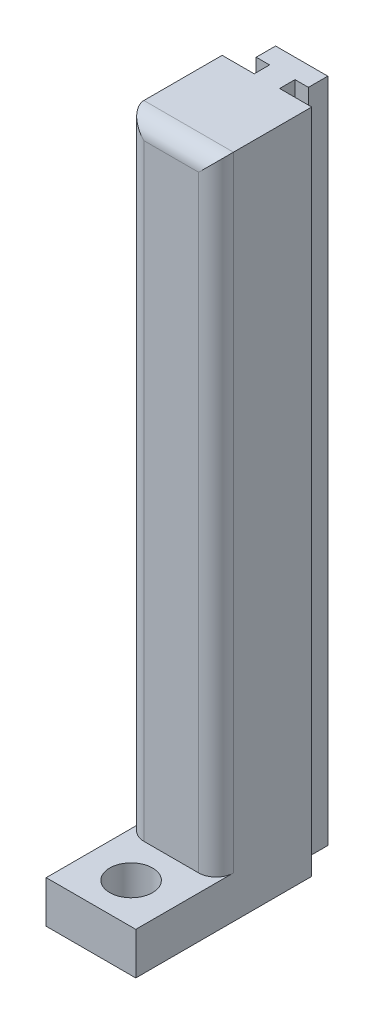
ISO-10303-21;
HEADER;
FILE_DESCRIPTION(('STEP AP214'),'2;1');
FILE_NAME('part.step','',(''),(''),'','','');
FILE_SCHEMA(('AUTOMOTIVE_DESIGN { 1 0 10303 214 1 1 1 1 }'));
ENDSEC;
DATA;
#1=APPLICATION_CONTEXT('core data for automotive mechanical design processes');
#2=APPLICATION_PROTOCOL_DEFINITION('international standard','automotive_design',2000,#1);
#3=PRODUCT_CONTEXT('',#1,'mechanical');
#4=PRODUCT('Part','Part','',(#3));
#5=PRODUCT_RELATED_PRODUCT_CATEGORY('part','',(#4));
#6=PRODUCT_DEFINITION_FORMATION('','',#4);
#7=PRODUCT_DEFINITION_CONTEXT('part definition',#1,'design');
#8=PRODUCT_DEFINITION('design','',#6,#7);
#9=PRODUCT_DEFINITION_SHAPE('','',#8);
#10=(LENGTH_UNIT() NAMED_UNIT(*) SI_UNIT(.MILLI.,.METRE.));
#11=(NAMED_UNIT(*) PLANE_ANGLE_UNIT() SI_UNIT($,.RADIAN.));
#12=(NAMED_UNIT(*) SI_UNIT($,.STERADIAN.) SOLID_ANGLE_UNIT());
#13=UNCERTAINTY_MEASURE_WITH_UNIT(LENGTH_MEASURE(1.E-05),#10,'distance_accuracy_value','');
#14=(GEOMETRIC_REPRESENTATION_CONTEXT(3) GLOBAL_UNCERTAINTY_ASSIGNED_CONTEXT((#13)) GLOBAL_UNIT_ASSIGNED_CONTEXT((#10,
#11,#12)) REPRESENTATION_CONTEXT('',''));
#15=CARTESIAN_POINT('',(0.,0.,0.));
#16=DIRECTION('',(0.,0.,1.));
#17=DIRECTION('',(1.,0.,0.));
#18=AXIS2_PLACEMENT_3D('',#15,#16,#17);
#19=CARTESIAN_POINT('',(4.25,63.246,-10.));
#20=DIRECTION('',(0.,0.,1.));
#21=DIRECTION('',(1.,0.,0.));
#22=AXIS2_PLACEMENT_3D('',#19,#20,#21);
#23=PLANE('',#22);
#24=DIRECTION('',(0.,-1.,0.));
#25=VECTOR('',#24,1.);
#26=CARTESIAN_POINT('',(2.4765,68.58,-10.));
#27=LINE('',#26,#25);
#28=CARTESIAN_POINT('',(2.4765,63.246,-10.));
#29=VERTEX_POINT('',#28);
#30=CARTESIAN_POINT('',(2.4765,0.,-10.));
#31=VERTEX_POINT('',#30);
#32=EDGE_CURVE('E150',#29,#31,#27,.T.);
#33=ORIENTED_EDGE('',*,*,#32,.T.);
#34=DIRECTION('',(-1.,0.,0.));
#35=VECTOR('',#34,1.);
#36=CARTESIAN_POINT('',(4.25,0.,-10.));
#37=LINE('',#36,#35);
#38=CARTESIAN_POINT('',(-2.4765,0.,-10.));
#39=VERTEX_POINT('',#38);
#40=EDGE_CURVE('E191',#31,#39,#37,.T.);
#41=ORIENTED_EDGE('',*,*,#40,.T.);
#42=DIRECTION('',(0.,-1.,0.));
#43=VECTOR('',#42,1.);
#44=CARTESIAN_POINT('',(-2.4765,68.58,-10.));
#45=LINE('',#44,#43);
#46=CARTESIAN_POINT('',(-2.4765,63.246,-10.));
#47=VERTEX_POINT('',#46);
#48=EDGE_CURVE('E176',#47,#39,#45,.T.);
#49=ORIENTED_EDGE('',*,*,#48,.F.);
#50=DIRECTION('',(-1.,0.,0.));
#51=VECTOR('',#50,1.);
#52=CARTESIAN_POINT('',(4.25,63.246,-10.));
#53=LINE('',#52,#51);
#54=EDGE_CURVE('E168',#29,#47,#53,.T.);
#55=ORIENTED_EDGE('',*,*,#54,.F.);
#56=EDGE_LOOP('',(#33,#41,#49,#55));
#57=FACE_BOUND('',#56,.T.);
#58=ADVANCED_FACE('F37',(#57),#23,.F.);
#59=CARTESIAN_POINT('',(0.,63.246,0.));
#60=DIRECTION('',(0.,1.,0.));
#61=DIRECTION('',(0.,0.,1.));
#62=AXIS2_PLACEMENT_3D('',#59,#60,#61);
#63=PLANE('',#62);
#64=DIRECTION('',(0.,0.,1.));
#65=VECTOR('',#64,1.);
#66=CARTESIAN_POINT('',(-4.25,63.246,-10.));
#67=LINE('',#66,#65);
#68=CARTESIAN_POINT('',(-4.25,63.246,-6.698));
#69=VERTEX_POINT('',#68);
#70=CARTESIAN_POINT('',(-4.25,63.246,0.729000000000002));
#71=VERTEX_POINT('',#70);
#72=EDGE_CURVE('E177',#69,#71,#67,.T.);
#73=ORIENTED_EDGE('',*,*,#72,.T.);
#74=DIRECTION('',(-1.,0.,0.));
#75=VECTOR('',#74,1.);
#76=CARTESIAN_POINT('',(4.25,63.246,0.729000000000001));
#77=LINE('',#76,#75);
#78=CARTESIAN_POINT('',(4.25,63.246,0.729000000000001));
#79=VERTEX_POINT('',#78);
#80=EDGE_CURVE('E228',#71,#79,#77,.F.);
#81=ORIENTED_EDGE('',*,*,#80,.T.);
#82=DIRECTION('',(0.,0.,-1.));
#83=VECTOR('',#82,1.);
#84=CARTESIAN_POINT('',(4.25,63.246,10.));
#85=LINE('',#84,#83);
#86=CARTESIAN_POINT('',(4.25,63.246,-6.698));
#87=VERTEX_POINT('',#86);
#88=EDGE_CURVE('E180',#79,#87,#85,.T.);
#89=ORIENTED_EDGE('',*,*,#88,.T.);
#90=DIRECTION('',(-1.,0.,0.));
#91=VECTOR('',#90,1.);
#92=CARTESIAN_POINT('',(0.,63.246,-6.698));
#93=LINE('',#92,#91);
#94=CARTESIAN_POINT('',(1.2065,63.246,-6.698));
#95=VERTEX_POINT('',#94);
#96=EDGE_CURVE('E257',#87,#95,#93,.T.);
#97=ORIENTED_EDGE('',*,*,#96,.T.);
#98=DIRECTION('',(0.,0.,-1.));
#99=VECTOR('',#98,1.);
#100=CARTESIAN_POINT('',(1.2065,63.246,0.));
#101=LINE('',#100,#99);
#102=CARTESIAN_POINT('',(1.2065,63.246,-8.1585));
#103=VERTEX_POINT('',#102);
#104=EDGE_CURVE('E172',#95,#103,#101,.T.);
#105=ORIENTED_EDGE('',*,*,#104,.T.);
#106=DIRECTION('',(1.,0.,0.));
#107=VECTOR('',#106,1.);
#108=CARTESIAN_POINT('',(0.,63.246,-8.1585));
#109=LINE('',#108,#107);
#110=CARTESIAN_POINT('',(2.4765,63.246,-8.1585));
#111=VERTEX_POINT('',#110);
#112=EDGE_CURVE('E171',#103,#111,#109,.T.);
#113=ORIENTED_EDGE('',*,*,#112,.T.);
#114=DIRECTION('',(0.,0.,-1.));
#115=VECTOR('',#114,1.);
#116=CARTESIAN_POINT('',(2.4765,63.246,0.));
#117=LINE('',#116,#115);
#118=EDGE_CURVE('E154',#111,#29,#117,.T.);
#119=ORIENTED_EDGE('',*,*,#118,.T.);
#120=ORIENTED_EDGE('',*,*,#54,.T.);
#121=DIRECTION('',(0.,0.,1.));
#122=VECTOR('',#121,1.);
#123=CARTESIAN_POINT('',(-2.4765,63.246,0.));
#124=LINE('',#123,#122);
#125=CARTESIAN_POINT('',(-2.4765,63.246,-8.1585));
#126=VERTEX_POINT('',#125);
#127=EDGE_CURVE('E277',#47,#126,#124,.T.);
#128=ORIENTED_EDGE('',*,*,#127,.T.);
#129=DIRECTION('',(1.,0.,0.));
#130=VECTOR('',#129,1.);
#131=CARTESIAN_POINT('',(0.,63.246,-8.1585));
#132=LINE('',#131,#130);
#133=CARTESIAN_POINT('',(-1.2065,63.246,-8.1585));
#134=VERTEX_POINT('',#133);
#135=EDGE_CURVE('E279',#126,#134,#132,.T.);
#136=ORIENTED_EDGE('',*,*,#135,.T.);
#137=DIRECTION('',(0.,0.,1.));
#138=VECTOR('',#137,1.);
#139=CARTESIAN_POINT('',(-1.2065,63.246,0.));
#140=LINE('',#139,#138);
#141=CARTESIAN_POINT('',(-1.2065,63.246,-6.698));
#142=VERTEX_POINT('',#141);
#143=EDGE_CURVE('E282',#134,#142,#140,.T.);
#144=ORIENTED_EDGE('',*,*,#143,.T.);
#145=DIRECTION('',(-1.,0.,0.));
#146=VECTOR('',#145,1.);
#147=CARTESIAN_POINT('',(0.,63.246,-6.698));
#148=LINE('',#147,#146);
#149=EDGE_CURVE('E274',#142,#69,#148,.T.);
#150=ORIENTED_EDGE('',*,*,#149,.T.);
#151=EDGE_LOOP('',(#73,#81,#89,#97,#105,#113,#119,#120,#128,#136,#144,#150));
#152=FACE_BOUND('',#151,.T.);
#153=ADVANCED_FACE('F166',(#152),#63,.T.);
#154=CARTESIAN_POINT('',(0.,0.,0.));
#155=DIRECTION('',(0.,1.,0.));
#156=DIRECTION('',(0.,0.,1.));
#157=AXIS2_PLACEMENT_3D('',#154,#155,#156);
#158=PLANE('',#157);
#159=CARTESIAN_POINT('',(0.,0.,6.19));
#160=DIRECTION('',(0.,1.,0.));
#161=DIRECTION('',(0.,0.,1.));
#162=AXIS2_PLACEMENT_3D('',#159,#160,#161);
#163=CIRCLE('',#162,2.032);
#164=CARTESIAN_POINT('',(0.,0.,8.222));
#165=VERTEX_POINT('',#164);
#166=EDGE_CURVE('E242',#165,#165,#163,.T.);
#167=ORIENTED_EDGE('',*,*,#166,.T.);
#168=EDGE_LOOP('',(#167));
#169=FACE_BOUND('',#168,.T.);
#170=DIRECTION('',(-1.,0.,0.));
#171=VECTOR('',#170,1.);
#172=CARTESIAN_POINT('',(0.,0.,-6.698));
#173=LINE('',#172,#171);
#174=CARTESIAN_POINT('',(4.25,0.,-6.698));
#175=VERTEX_POINT('',#174);
#176=CARTESIAN_POINT('',(1.2065,0.,-6.698));
#177=VERTEX_POINT('',#176);
#178=EDGE_CURVE('E255',#175,#177,#173,.T.);
#179=ORIENTED_EDGE('',*,*,#178,.F.);
#180=DIRECTION('',(0.,0.,-1.));
#181=VECTOR('',#180,1.);
#182=CARTESIAN_POINT('',(4.25,0.,10.));
#183=LINE('',#182,#181);
#184=CARTESIAN_POINT('',(4.25,0.,10.));
#185=VERTEX_POINT('',#184);
#186=EDGE_CURVE('E178',#185,#175,#183,.T.);
#187=ORIENTED_EDGE('',*,*,#186,.F.);
#188=DIRECTION('',(1.,0.,0.));
#189=VECTOR('',#188,1.);
#190=CARTESIAN_POINT('',(-4.25,0.,10.));
#191=LINE('',#190,#189);
#192=CARTESIAN_POINT('',(-4.25,0.,10.));
#193=VERTEX_POINT('',#192);
#194=EDGE_CURVE('E183',#193,#185,#191,.T.);
#195=ORIENTED_EDGE('',*,*,#194,.F.);
#196=DIRECTION('',(0.,0.,1.));
#197=VECTOR('',#196,1.);
#198=CARTESIAN_POINT('',(-4.25,0.,-10.));
#199=LINE('',#198,#197);
#200=CARTESIAN_POINT('',(-4.25,0.,-6.698));
#201=VERTEX_POINT('',#200);
#202=EDGE_CURVE('E193',#201,#193,#199,.T.);
#203=ORIENTED_EDGE('',*,*,#202,.F.);
#204=DIRECTION('',(-1.,0.,0.));
#205=VECTOR('',#204,1.);
#206=CARTESIAN_POINT('',(0.,0.,-6.698));
#207=LINE('',#206,#205);
#208=CARTESIAN_POINT('',(-1.2065,0.,-6.698));
#209=VERTEX_POINT('',#208);
#210=EDGE_CURVE('E201',#209,#201,#207,.T.);
#211=ORIENTED_EDGE('',*,*,#210,.F.);
#212=DIRECTION('',(0.,0.,1.));
#213=VECTOR('',#212,1.);
#214=CARTESIAN_POINT('',(-1.2065,0.,0.));
#215=LINE('',#214,#213);
#216=CARTESIAN_POINT('',(-1.2065,0.,-8.1585));
#217=VERTEX_POINT('',#216);
#218=EDGE_CURVE('E203',#217,#209,#215,.T.);
#219=ORIENTED_EDGE('',*,*,#218,.F.);
#220=DIRECTION('',(1.,0.,0.));
#221=VECTOR('',#220,1.);
#222=CARTESIAN_POINT('',(0.,0.,-8.1585));
#223=LINE('',#222,#221);
#224=CARTESIAN_POINT('',(-2.4765,0.,-8.1585));
#225=VERTEX_POINT('',#224);
#226=EDGE_CURVE('E206',#225,#217,#223,.T.);
#227=ORIENTED_EDGE('',*,*,#226,.F.);
#228=DIRECTION('',(0.,0.,1.));
#229=VECTOR('',#228,1.);
#230=CARTESIAN_POINT('',(-2.4765,0.,0.));
#231=LINE('',#230,#229);
#232=EDGE_CURVE('E208',#39,#225,#231,.T.);
#233=ORIENTED_EDGE('',*,*,#232,.F.);
#234=ORIENTED_EDGE('',*,*,#40,.F.);
#235=DIRECTION('',(0.,0.,-1.));
#236=VECTOR('',#235,1.);
#237=CARTESIAN_POINT('',(2.4765,0.,0.));
#238=LINE('',#237,#236);
#239=CARTESIAN_POINT('',(2.4765,0.,-8.1585));
#240=VERTEX_POINT('',#239);
#241=EDGE_CURVE('E157',#240,#31,#238,.T.);
#242=ORIENTED_EDGE('',*,*,#241,.F.);
#243=DIRECTION('',(1.,0.,0.));
#244=VECTOR('',#243,1.);
#245=CARTESIAN_POINT('',(0.,0.,-8.1585));
#246=LINE('',#245,#244);
#247=CARTESIAN_POINT('',(1.2065,0.,-8.1585));
#248=VERTEX_POINT('',#247);
#249=EDGE_CURVE('E212',#248,#240,#246,.T.);
#250=ORIENTED_EDGE('',*,*,#249,.F.);
#251=DIRECTION('',(0.,0.,-1.));
#252=VECTOR('',#251,1.);
#253=CARTESIAN_POINT('',(1.2065,0.,0.));
#254=LINE('',#253,#252);
#255=EDGE_CURVE('E215',#177,#248,#254,.T.);
#256=ORIENTED_EDGE('',*,*,#255,.F.);
#257=EDGE_LOOP('',(#179,#187,#195,#203,#211,#219,#227,#233,#234,#242,#250,#256));
#258=FACE_BOUND('',#257,.T.);
#259=ADVANCED_FACE('F316',(#169,#258),#158,.F.);
#260=CARTESIAN_POINT('',(4.25,63.246,10.));
#261=DIRECTION('',(-1.,0.,0.));
#262=DIRECTION('',(0.,0.,1.));
#263=AXIS2_PLACEMENT_3D('',#260,#261,#262);
#264=PLANE('',#263);
#265=ORIENTED_EDGE('',*,*,#88,.F.);
#266=DIRECTION('',(0.,1.,0.));
#267=VECTOR('',#266,1.);
#268=CARTESIAN_POINT('',(4.25,63.246,0.729000000000002));
#269=LINE('',#268,#267);
#270=CARTESIAN_POINT('',(4.25,4.,0.729000000000002));
#271=VERTEX_POINT('',#270);
#272=EDGE_CURVE('E224',#79,#271,#269,.F.);
#273=ORIENTED_EDGE('',*,*,#272,.T.);
#274=DIRECTION('',(0.,0.,1.));
#275=VECTOR('',#274,1.);
#276=CARTESIAN_POINT('',(4.25,4.,10.));
#277=LINE('',#276,#275);
#278=CARTESIAN_POINT('',(4.25,4.,10.));
#279=VERTEX_POINT('',#278);
#280=EDGE_CURVE('E288',#271,#279,#277,.T.);
#281=ORIENTED_EDGE('',*,*,#280,.T.);
#282=DIRECTION('',(0.,-1.,0.));
#283=VECTOR('',#282,1.);
#284=CARTESIAN_POINT('',(4.25,63.246,10.));
#285=LINE('',#284,#283);
#286=EDGE_CURVE('E190',#279,#185,#285,.T.);
#287=ORIENTED_EDGE('',*,*,#286,.T.);
#288=ORIENTED_EDGE('',*,*,#186,.T.);
#289=DIRECTION('',(0.,-1.,0.));
#290=VECTOR('',#289,1.);
#291=CARTESIAN_POINT('',(4.25,63.246,-6.698));
#292=LINE('',#291,#290);
#293=EDGE_CURVE('E210',#87,#175,#292,.T.);
#294=ORIENTED_EDGE('',*,*,#293,.F.);
#295=EDGE_LOOP('',(#265,#273,#281,#287,#288,#294));
#296=FACE_BOUND('',#295,.T.);
#297=ADVANCED_FACE('F303',(#296),#264,.F.);
#298=CARTESIAN_POINT('',(-4.25,63.246,-10.));
#299=DIRECTION('',(1.,0.,0.));
#300=DIRECTION('',(0.,0.,-1.));
#301=AXIS2_PLACEMENT_3D('',#298,#299,#300);
#302=PLANE('',#301);
#303=DIRECTION('',(0.,0.,-1.));
#304=VECTOR('',#303,1.);
#305=CARTESIAN_POINT('',(-4.25,4.,2.38));
#306=LINE('',#305,#304);
#307=CARTESIAN_POINT('',(-4.25,4.,10.));
#308=VERTEX_POINT('',#307);
#309=CARTESIAN_POINT('',(-4.25,4.,0.729000000000001));
#310=VERTEX_POINT('',#309);
#311=EDGE_CURVE('E54',#308,#310,#306,.T.);
#312=ORIENTED_EDGE('',*,*,#311,.T.);
#313=DIRECTION('',(0.,1.,0.));
#314=VECTOR('',#313,1.);
#315=CARTESIAN_POINT('',(-4.25,63.246,0.729000000000001));
#316=LINE('',#315,#314);
#317=EDGE_CURVE('E58',#310,#71,#316,.T.);
#318=ORIENTED_EDGE('',*,*,#317,.T.);
#319=ORIENTED_EDGE('',*,*,#72,.F.);
#320=DIRECTION('',(0.,-1.,0.));
#321=VECTOR('',#320,1.);
#322=CARTESIAN_POINT('',(-4.25,68.58,-6.698));
#323=LINE('',#322,#321);
#324=EDGE_CURVE('E264',#69,#201,#323,.T.);
#325=ORIENTED_EDGE('',*,*,#324,.T.);
#326=ORIENTED_EDGE('',*,*,#202,.T.);
#327=DIRECTION('',(0.,-1.,0.));
#328=VECTOR('',#327,1.);
#329=CARTESIAN_POINT('',(-4.25,63.246,10.));
#330=LINE('',#329,#328);
#331=EDGE_CURVE('E198',#308,#193,#330,.T.);
#332=ORIENTED_EDGE('',*,*,#331,.F.);
#333=EDGE_LOOP('',(#312,#318,#319,#325,#326,#332));
#334=FACE_BOUND('',#333,.T.);
#335=ADVANCED_FACE('F338',(#334),#302,.F.);
#336=CARTESIAN_POINT('',(-4.25,63.246,10.));
#337=DIRECTION('',(0.,0.,-1.));
#338=DIRECTION('',(-1.,0.,0.));
#339=AXIS2_PLACEMENT_3D('',#336,#337,#338);
#340=PLANE('',#339);
#341=DIRECTION('',(-1.,0.,0.));
#342=VECTOR('',#341,1.);
#343=CARTESIAN_POINT('',(-4.25,4.,10.));
#344=LINE('',#343,#342);
#345=EDGE_CURVE('E286',#279,#308,#344,.T.);
#346=ORIENTED_EDGE('',*,*,#345,.T.);
#347=ORIENTED_EDGE('',*,*,#331,.T.);
#348=ORIENTED_EDGE('',*,*,#194,.T.);
#349=ORIENTED_EDGE('',*,*,#286,.F.);
#350=EDGE_LOOP('',(#346,#347,#348,#349));
#351=FACE_BOUND('',#350,.T.);
#352=ADVANCED_FACE('F351',(#351),#340,.F.);
#353=CARTESIAN_POINT('',(4.25,-11.4155332770747,2.38));
#354=DIRECTION('',(0.,0.,-1.));
#355=DIRECTION('',(-1.,0.,0.));
#356=AXIS2_PLACEMENT_3D('',#353,#354,#355);
#357=PLANE('',#356);
#358=DIRECTION('',(1.,0.,0.));
#359=VECTOR('',#358,1.);
#360=CARTESIAN_POINT('',(4.25,4.,2.38));
#361=LINE('',#360,#359);
#362=CARTESIAN_POINT('',(-2.599,4.,2.38));
#363=VERTEX_POINT('',#362);
#364=CARTESIAN_POINT('',(2.599,4.,2.38));
#365=VERTEX_POINT('',#364);
#366=EDGE_CURVE('E186',#363,#365,#361,.T.);
#367=ORIENTED_EDGE('',*,*,#366,.T.);
#368=DIRECTION('',(0.,1.,0.));
#369=VECTOR('',#368,1.);
#370=CARTESIAN_POINT('',(2.599,-11.4155332770747,2.38));
#371=LINE('',#370,#369);
#372=CARTESIAN_POINT('',(2.599,61.595,2.38));
#373=VERTEX_POINT('',#372);
#374=EDGE_CURVE('E221',#365,#373,#371,.T.);
#375=ORIENTED_EDGE('',*,*,#374,.T.);
#376=DIRECTION('',(-1.,0.,0.));
#377=VECTOR('',#376,1.);
#378=CARTESIAN_POINT('',(-4.25,61.595,2.38));
#379=LINE('',#378,#377);
#380=CARTESIAN_POINT('',(-2.599,61.595,2.38));
#381=VERTEX_POINT('',#380);
#382=EDGE_CURVE('E217',#373,#381,#379,.T.);
#383=ORIENTED_EDGE('',*,*,#382,.T.);
#384=DIRECTION('',(0.,1.,0.));
#385=VECTOR('',#384,1.);
#386=CARTESIAN_POINT('',(-2.599,-11.4155332770747,2.38));
#387=LINE('',#386,#385);
#388=EDGE_CURVE('E219',#381,#363,#387,.F.);
#389=ORIENTED_EDGE('',*,*,#388,.T.);
#390=EDGE_LOOP('',(#367,#375,#383,#389));
#391=FACE_BOUND('',#390,.T.);
#392=ADVANCED_FACE('F295',(#391),#357,.F.);
#393=CARTESIAN_POINT('',(0.,4.,0.));
#394=DIRECTION('',(0.,1.,0.));
#395=DIRECTION('',(0.,0.,1.));
#396=AXIS2_PLACEMENT_3D('',#393,#394,#395);
#397=PLANE('',#396);
#398=CARTESIAN_POINT('',(0.,4.,6.19));
#399=DIRECTION('',(0.,1.,0.));
#400=DIRECTION('',(0.,0.,1.));
#401=AXIS2_PLACEMENT_3D('',#398,#399,#400);
#402=CIRCLE('',#401,2.032);
#403=CARTESIAN_POINT('',(0.,4.,8.222));
#404=VERTEX_POINT('',#403);
#405=EDGE_CURVE('E237',#404,#404,#402,.T.);
#406=ORIENTED_EDGE('',*,*,#405,.F.);
#407=EDGE_LOOP('',(#406));
#408=FACE_BOUND('',#407,.T.);
#409=ORIENTED_EDGE('',*,*,#280,.F.);
#410=CARTESIAN_POINT('',(2.599,4.,0.729000000000001));
#411=DIRECTION('',(0.,1.,0.));
#412=DIRECTION('',(0.,0.,1.));
#413=AXIS2_PLACEMENT_3D('',#410,#411,#412);
#414=CIRCLE('',#413,1.651);
#415=EDGE_CURVE('E46',#271,#365,#414,.F.);
#416=ORIENTED_EDGE('',*,*,#415,.T.);
#417=ORIENTED_EDGE('',*,*,#366,.F.);
#418=CARTESIAN_POINT('',(-2.599,4.,0.729000000000001));
#419=DIRECTION('',(0.,1.,0.));
#420=DIRECTION('',(0.,0.,1.));
#421=AXIS2_PLACEMENT_3D('',#418,#419,#420);
#422=CIRCLE('',#421,1.651);
#423=EDGE_CURVE('E12',#363,#310,#422,.F.);
#424=ORIENTED_EDGE('',*,*,#423,.T.);
#425=ORIENTED_EDGE('',*,*,#311,.F.);
#426=ORIENTED_EDGE('',*,*,#345,.F.);
#427=EDGE_LOOP('',(#409,#416,#417,#424,#425,#426));
#428=FACE_BOUND('',#427,.T.);
#429=ADVANCED_FACE('F301',(#408,#428),#397,.T.);
#430=CARTESIAN_POINT('',(-1.2065,68.58,-8.1585));
#431=DIRECTION('',(-1.,0.,0.));
#432=DIRECTION('',(0.,0.,1.));
#433=AXIS2_PLACEMENT_3D('',#430,#431,#432);
#434=PLANE('',#433);
#435=DIRECTION('',(0.,-1.,0.));
#436=VECTOR('',#435,1.);
#437=CARTESIAN_POINT('',(-1.2065,68.58,-8.1585));
#438=LINE('',#437,#436);
#439=EDGE_CURVE('E271',#134,#217,#438,.T.);
#440=ORIENTED_EDGE('',*,*,#439,.T.);
#441=ORIENTED_EDGE('',*,*,#218,.T.);
#442=DIRECTION('',(0.,-1.,0.));
#443=VECTOR('',#442,1.);
#444=CARTESIAN_POINT('',(-1.2065,68.58,-6.698));
#445=LINE('',#444,#443);
#446=EDGE_CURVE('E262',#142,#209,#445,.T.);
#447=ORIENTED_EDGE('',*,*,#446,.F.);
#448=ORIENTED_EDGE('',*,*,#143,.F.);
#449=EDGE_LOOP('',(#440,#441,#447,#448));
#450=FACE_BOUND('',#449,.T.);
#451=ADVANCED_FACE('F361',(#450),#434,.T.);
#452=CARTESIAN_POINT('',(-2.4765,68.58,-8.1585));
#453=DIRECTION('',(0.,0.,1.));
#454=DIRECTION('',(1.,0.,0.));
#455=AXIS2_PLACEMENT_3D('',#452,#453,#454);
#456=PLANE('',#455);
#457=DIRECTION('',(0.,-1.,0.));
#458=VECTOR('',#457,1.);
#459=CARTESIAN_POINT('',(-2.4765,68.58,-8.1585));
#460=LINE('',#459,#458);
#461=EDGE_CURVE('E268',#126,#225,#460,.T.);
#462=ORIENTED_EDGE('',*,*,#461,.T.);
#463=ORIENTED_EDGE('',*,*,#226,.T.);
#464=ORIENTED_EDGE('',*,*,#439,.F.);
#465=ORIENTED_EDGE('',*,*,#135,.F.);
#466=EDGE_LOOP('',(#462,#463,#464,#465));
#467=FACE_BOUND('',#466,.T.);
#468=ADVANCED_FACE('F364',(#467),#456,.T.);
#469=CARTESIAN_POINT('',(-2.4765,68.58,-10.));
#470=DIRECTION('',(-1.,0.,0.));
#471=DIRECTION('',(0.,0.,1.));
#472=AXIS2_PLACEMENT_3D('',#469,#470,#471);
#473=PLANE('',#472);
#474=ORIENTED_EDGE('',*,*,#48,.T.);
#475=ORIENTED_EDGE('',*,*,#232,.T.);
#476=ORIENTED_EDGE('',*,*,#461,.F.);
#477=ORIENTED_EDGE('',*,*,#127,.F.);
#478=EDGE_LOOP('',(#474,#475,#476,#477));
#479=FACE_BOUND('',#478,.T.);
#480=ADVANCED_FACE('F367',(#479),#473,.T.);
#481=CARTESIAN_POINT('',(-1.2065,68.58,-6.698));
#482=DIRECTION('',(0.,0.,-1.));
#483=DIRECTION('',(-1.,0.,0.));
#484=AXIS2_PLACEMENT_3D('',#481,#482,#483);
#485=PLANE('',#484);
#486=ORIENTED_EDGE('',*,*,#446,.T.);
#487=ORIENTED_EDGE('',*,*,#210,.T.);
#488=ORIENTED_EDGE('',*,*,#324,.F.);
#489=ORIENTED_EDGE('',*,*,#149,.F.);
#490=EDGE_LOOP('',(#486,#487,#488,#489));
#491=FACE_BOUND('',#490,.T.);
#492=ADVANCED_FACE('F358',(#491),#485,.T.);
#493=CARTESIAN_POINT('',(1.2065,68.58,-8.1585));
#494=DIRECTION('',(1.,0.,0.));
#495=DIRECTION('',(0.,0.,-1.));
#496=AXIS2_PLACEMENT_3D('',#493,#494,#495);
#497=PLANE('',#496);
#498=DIRECTION('',(0.,-1.,0.));
#499=VECTOR('',#498,1.);
#500=CARTESIAN_POINT('',(1.2065,68.58,-6.698));
#501=LINE('',#500,#499);
#502=EDGE_CURVE('E161',#95,#177,#501,.T.);
#503=ORIENTED_EDGE('',*,*,#502,.T.);
#504=ORIENTED_EDGE('',*,*,#255,.T.);
#505=DIRECTION('',(0.,-1.,0.));
#506=VECTOR('',#505,1.);
#507=CARTESIAN_POINT('',(1.2065,68.58,-8.1585));
#508=LINE('',#507,#506);
#509=EDGE_CURVE('E247',#103,#248,#508,.T.);
#510=ORIENTED_EDGE('',*,*,#509,.F.);
#511=ORIENTED_EDGE('',*,*,#104,.F.);
#512=EDGE_LOOP('',(#503,#504,#510,#511));
#513=FACE_BOUND('',#512,.T.);
#514=ADVANCED_FACE('F312',(#513),#497,.T.);
#515=CARTESIAN_POINT('',(2.4765,68.58,-10.));
#516=DIRECTION('',(1.,0.,0.));
#517=DIRECTION('',(0.,0.,-1.));
#518=AXIS2_PLACEMENT_3D('',#515,#516,#517);
#519=PLANE('',#518);
#520=DIRECTION('',(0.,-1.,0.));
#521=VECTOR('',#520,1.);
#522=CARTESIAN_POINT('',(2.4765,68.58,-8.1585));
#523=LINE('',#522,#521);
#524=EDGE_CURVE('E162',#111,#240,#523,.T.);
#525=ORIENTED_EDGE('',*,*,#524,.T.);
#526=ORIENTED_EDGE('',*,*,#241,.T.);
#527=ORIENTED_EDGE('',*,*,#32,.F.);
#528=ORIENTED_EDGE('',*,*,#118,.F.);
#529=EDGE_LOOP('',(#525,#526,#527,#528));
#530=FACE_BOUND('',#529,.T.);
#531=ADVANCED_FACE('F153',(#530),#519,.T.);
#532=CARTESIAN_POINT('',(2.4765,68.58,-8.1585));
#533=DIRECTION('',(0.,0.,1.));
#534=DIRECTION('',(1.,0.,0.));
#535=AXIS2_PLACEMENT_3D('',#532,#533,#534);
#536=PLANE('',#535);
#537=ORIENTED_EDGE('',*,*,#509,.T.);
#538=ORIENTED_EDGE('',*,*,#249,.T.);
#539=ORIENTED_EDGE('',*,*,#524,.F.);
#540=ORIENTED_EDGE('',*,*,#112,.F.);
#541=EDGE_LOOP('',(#537,#538,#539,#540));
#542=FACE_BOUND('',#541,.T.);
#543=ADVANCED_FACE('F319',(#542),#536,.T.);
#544=CARTESIAN_POINT('',(1.2065,68.58,-6.698));
#545=DIRECTION('',(0.,0.,-1.));
#546=DIRECTION('',(-1.,0.,0.));
#547=AXIS2_PLACEMENT_3D('',#544,#545,#546);
#548=PLANE('',#547);
#549=ORIENTED_EDGE('',*,*,#293,.T.);
#550=ORIENTED_EDGE('',*,*,#178,.T.);
#551=ORIENTED_EDGE('',*,*,#502,.F.);
#552=ORIENTED_EDGE('',*,*,#96,.F.);
#553=EDGE_LOOP('',(#549,#550,#551,#552));
#554=FACE_BOUND('',#553,.T.);
#555=ADVANCED_FACE('F308',(#554),#548,.T.);
#556=CARTESIAN_POINT('',(0.,-75.922,6.19));
#557=DIRECTION('',(0.,1.,0.));
#558=DIRECTION('',(0.,0.,1.));
#559=AXIS2_PLACEMENT_3D('',#556,#557,#558);
#560=CYLINDRICAL_SURFACE('',#559,2.032);
#561=ORIENTED_EDGE('',*,*,#405,.T.);
#562=EDGE_LOOP('',(#561));
#563=FACE_BOUND('',#562,.T.);
#564=ORIENTED_EDGE('',*,*,#166,.F.);
#565=EDGE_LOOP('',(#564));
#566=FACE_BOUND('',#565,.T.);
#567=ADVANCED_FACE('F326',(#563,#566),#560,.F.);
#568=CARTESIAN_POINT('',(-2.599,63.246,0.729000000000001));
#569=DIRECTION('',(0.,1.,0.));
#570=DIRECTION('',(0.,0.,1.));
#571=AXIS2_PLACEMENT_3D('',#568,#569,#570);
#572=CYLINDRICAL_SURFACE('',#571,1.651);
#573=ORIENTED_EDGE('',*,*,#423,.F.);
#574=ORIENTED_EDGE('',*,*,#388,.F.);
#575=CARTESIAN_POINT('',(-2.599,61.595,0.729000000000001));
#576=DIRECTION('',(0.707106781186547,0.707106781186547,0.));
#577=DIRECTION('',(0.707106781186547,-0.707106781186547,0.));
#578=AXIS2_PLACEMENT_3D('',#575,#576,#577);
#579=ELLIPSE('',#578,2.33486659147798,1.651);
#580=EDGE_CURVE('E41',#71,#381,#579,.T.);
#581=ORIENTED_EDGE('',*,*,#580,.F.);
#582=ORIENTED_EDGE('',*,*,#317,.F.);
#583=EDGE_LOOP('',(#573,#574,#581,#582));
#584=FACE_BOUND('',#583,.T.);
#585=ADVANCED_FACE('F39',(#584),#572,.T.);
#586=CARTESIAN_POINT('',(4.25,61.595,0.729000000000001));
#587=DIRECTION('',(1.,0.,0.));
#588=DIRECTION('',(0.,0.,-1.));
#589=AXIS2_PLACEMENT_3D('',#586,#587,#588);
#590=CYLINDRICAL_SURFACE('',#589,1.651);
#591=ORIENTED_EDGE('',*,*,#580,.T.);
#592=ORIENTED_EDGE('',*,*,#382,.F.);
#593=CARTESIAN_POINT('',(2.599,61.595,0.729000000000001));
#594=DIRECTION('',(0.707106781186547,-0.707106781186547,0.));
#595=DIRECTION('',(0.707106781186547,0.707106781186547,0.));
#596=AXIS2_PLACEMENT_3D('',#593,#594,#595);
#597=ELLIPSE('',#596,2.33486659147798,1.651);
#598=EDGE_CURVE('E230',#79,#373,#597,.T.);
#599=ORIENTED_EDGE('',*,*,#598,.F.);
#600=ORIENTED_EDGE('',*,*,#80,.F.);
#601=EDGE_LOOP('',(#591,#592,#599,#600));
#602=FACE_BOUND('',#601,.T.);
#603=ADVANCED_FACE('F341',(#602),#590,.T.);
#604=CARTESIAN_POINT('',(2.599,-11.4155332770747,0.729000000000001));
#605=DIRECTION('',(0.,1.,0.));
#606=DIRECTION('',(0.,0.,1.));
#607=AXIS2_PLACEMENT_3D('',#604,#605,#606);
#608=CYLINDRICAL_SURFACE('',#607,1.651);
#609=ORIENTED_EDGE('',*,*,#415,.F.);
#610=ORIENTED_EDGE('',*,*,#272,.F.);
#611=ORIENTED_EDGE('',*,*,#598,.T.);
#612=ORIENTED_EDGE('',*,*,#374,.F.);
#613=EDGE_LOOP('',(#609,#610,#611,#612));
#614=FACE_BOUND('',#613,.T.);
#615=ADVANCED_FACE('F300',(#614),#608,.T.);
#616=CLOSED_SHELL('',(#58,#153,#259,#297,#335,#352,#392,#429,#451,#468,#480,#492,#514,#531,#543,
#555,#567,#585,#603,#615));
#617=MANIFOLD_SOLID_BREP('B2',#616);
#618=ADVANCED_BREP_SHAPE_REPRESENTATION('',(#18,#617),#14);
#619=SHAPE_DEFINITION_REPRESENTATION(#9,#618);
ENDSEC;
END-ISO-10303-21;
